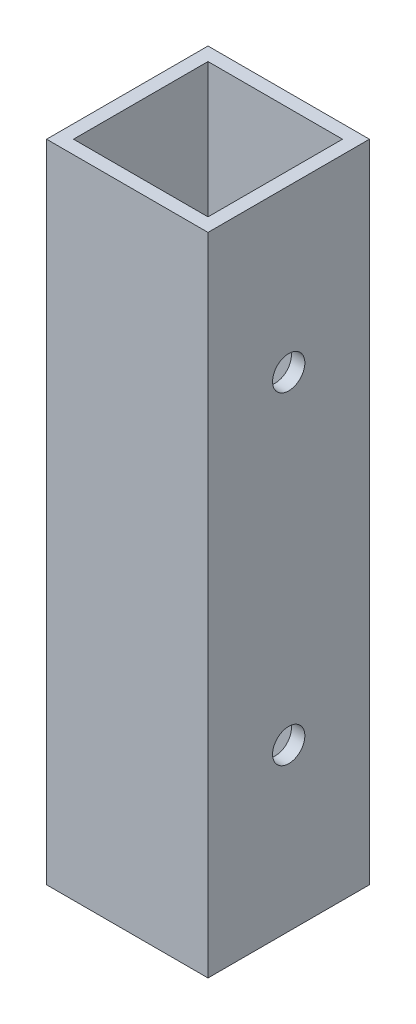
ISO-10303-21;
HEADER;
FILE_DESCRIPTION(('STEP AP214'),'2;1');
FILE_NAME('part.step','',(''),(''),'','','');
FILE_SCHEMA(('AUTOMOTIVE_DESIGN { 1 0 10303 214 1 1 1 1 }'));
ENDSEC;
DATA;
#1=APPLICATION_CONTEXT('core data for automotive mechanical design processes');
#2=APPLICATION_PROTOCOL_DEFINITION('international standard','automotive_design',2000,#1);
#3=PRODUCT_CONTEXT('',#1,'mechanical');
#4=PRODUCT('Part','Part','',(#3));
#5=PRODUCT_RELATED_PRODUCT_CATEGORY('part','',(#4));
#6=PRODUCT_DEFINITION_FORMATION('','',#4);
#7=PRODUCT_DEFINITION_CONTEXT('part definition',#1,'design');
#8=PRODUCT_DEFINITION('design','',#6,#7);
#9=PRODUCT_DEFINITION_SHAPE('','',#8);
#10=(LENGTH_UNIT() NAMED_UNIT(*) SI_UNIT(.MILLI.,.METRE.));
#11=(NAMED_UNIT(*) PLANE_ANGLE_UNIT() SI_UNIT($,.RADIAN.));
#12=(NAMED_UNIT(*) SI_UNIT($,.STERADIAN.) SOLID_ANGLE_UNIT());
#13=UNCERTAINTY_MEASURE_WITH_UNIT(LENGTH_MEASURE(1.E-05),#10,'distance_accuracy_value','');
#14=(GEOMETRIC_REPRESENTATION_CONTEXT(3) GLOBAL_UNCERTAINTY_ASSIGNED_CONTEXT((#13)) GLOBAL_UNIT_ASSIGNED_CONTEXT((#10,
#11,#12)) REPRESENTATION_CONTEXT('',''));
#15=CARTESIAN_POINT('',(0.,0.,0.));
#16=DIRECTION('',(0.,0.,1.));
#17=DIRECTION('',(1.,0.,0.));
#18=AXIS2_PLACEMENT_3D('',#15,#16,#17);
#19=CARTESIAN_POINT('',(-19.05,152.4,19.05));
#20=DIRECTION('',(0.,1.,0.));
#21=DIRECTION('',(0.,0.,1.));
#22=AXIS2_PLACEMENT_3D('',#19,#20,#21);
#23=PLANE('',#22);
#24=DIRECTION('',(0.,0.,1.));
#25=VECTOR('',#24,1.);
#26=CARTESIAN_POINT('',(-19.05,152.4,-19.05));
#27=LINE('',#26,#25);
#28=CARTESIAN_POINT('',(-19.05,152.4,-19.05));
#29=VERTEX_POINT('',#28);
#30=CARTESIAN_POINT('',(-19.05,152.4,19.05));
#31=VERTEX_POINT('',#30);
#32=EDGE_CURVE('E138',#29,#31,#27,.T.);
#33=ORIENTED_EDGE('',*,*,#32,.T.);
#34=DIRECTION('',(1.,0.,0.));
#35=VECTOR('',#34,1.);
#36=CARTESIAN_POINT('',(-19.05,152.4,19.05));
#37=LINE('',#36,#35);
#38=CARTESIAN_POINT('',(19.05,152.4,19.05));
#39=VERTEX_POINT('',#38);
#40=EDGE_CURVE('E141',#31,#39,#37,.T.);
#41=ORIENTED_EDGE('',*,*,#40,.T.);
#42=DIRECTION('',(0.,0.,-1.));
#43=VECTOR('',#42,1.);
#44=CARTESIAN_POINT('',(19.05,152.4,-19.05));
#45=LINE('',#44,#43);
#46=CARTESIAN_POINT('',(19.05,152.4,-19.05));
#47=VERTEX_POINT('',#46);
#48=EDGE_CURVE('E144',#39,#47,#45,.T.);
#49=ORIENTED_EDGE('',*,*,#48,.T.);
#50=DIRECTION('',(-1.,0.,0.));
#51=VECTOR('',#50,1.);
#52=CARTESIAN_POINT('',(-19.05,152.4,-19.05));
#53=LINE('',#52,#51);
#54=EDGE_CURVE('E146',#47,#29,#53,.T.);
#55=ORIENTED_EDGE('',*,*,#54,.T.);
#56=EDGE_LOOP('',(#33,#41,#49,#55));
#57=FACE_BOUND('',#56,.T.);
#58=DIRECTION('',(1.,0.,0.));
#59=VECTOR('',#58,1.);
#60=CARTESIAN_POINT('',(-15.875,152.4,15.875));
#61=LINE('',#60,#59);
#62=CARTESIAN_POINT('',(-15.875,152.4,15.875));
#63=VERTEX_POINT('',#62);
#64=CARTESIAN_POINT('',(15.875,152.4,15.875));
#65=VERTEX_POINT('',#64);
#66=EDGE_CURVE('E108',#63,#65,#61,.T.);
#67=ORIENTED_EDGE('',*,*,#66,.F.);
#68=DIRECTION('',(0.,0.,1.));
#69=VECTOR('',#68,1.);
#70=CARTESIAN_POINT('',(-15.875,152.4,-15.875));
#71=LINE('',#70,#69);
#72=CARTESIAN_POINT('',(-15.875,152.4,-15.875));
#73=VERTEX_POINT('',#72);
#74=EDGE_CURVE('E100',#73,#63,#71,.T.);
#75=ORIENTED_EDGE('',*,*,#74,.F.);
#76=DIRECTION('',(-1.,0.,0.));
#77=VECTOR('',#76,1.);
#78=CARTESIAN_POINT('',(-15.875,152.4,-15.875));
#79=LINE('',#78,#77);
#80=CARTESIAN_POINT('',(15.875,152.4,-15.875));
#81=VERTEX_POINT('',#80);
#82=EDGE_CURVE('E122',#81,#73,#79,.T.);
#83=ORIENTED_EDGE('',*,*,#82,.F.);
#84=DIRECTION('',(0.,0.,-1.));
#85=VECTOR('',#84,1.);
#86=CARTESIAN_POINT('',(15.875,152.4,-15.875));
#87=LINE('',#86,#85);
#88=EDGE_CURVE('E120',#65,#81,#87,.T.);
#89=ORIENTED_EDGE('',*,*,#88,.F.);
#90=EDGE_LOOP('',(#67,#75,#83,#89));
#91=FACE_BOUND('',#90,.T.);
#92=ADVANCED_FACE('F33',(#57,#91),#23,.T.);
#93=CARTESIAN_POINT('',(-19.05,0.,19.05));
#94=DIRECTION('',(0.,1.,0.));
#95=DIRECTION('',(0.,0.,1.));
#96=AXIS2_PLACEMENT_3D('',#93,#94,#95);
#97=PLANE('',#96);
#98=DIRECTION('',(0.,0.,1.));
#99=VECTOR('',#98,1.);
#100=CARTESIAN_POINT('',(-19.05,0.,-19.05));
#101=LINE('',#100,#99);
#102=CARTESIAN_POINT('',(-19.05,0.,-19.05));
#103=VERTEX_POINT('',#102);
#104=CARTESIAN_POINT('',(-19.05,0.,19.05));
#105=VERTEX_POINT('',#104);
#106=EDGE_CURVE('E116',#103,#105,#101,.T.);
#107=ORIENTED_EDGE('',*,*,#106,.F.);
#108=DIRECTION('',(-1.,0.,0.));
#109=VECTOR('',#108,1.);
#110=CARTESIAN_POINT('',(-19.05,0.,-19.05));
#111=LINE('',#110,#109);
#112=CARTESIAN_POINT('',(19.05,0.,-19.05));
#113=VERTEX_POINT('',#112);
#114=EDGE_CURVE('E142',#113,#103,#111,.T.);
#115=ORIENTED_EDGE('',*,*,#114,.F.);
#116=DIRECTION('',(0.,0.,-1.));
#117=VECTOR('',#116,1.);
#118=CARTESIAN_POINT('',(19.05,0.,-19.05));
#119=LINE('',#118,#117);
#120=CARTESIAN_POINT('',(19.05,0.,19.05));
#121=VERTEX_POINT('',#120);
#122=EDGE_CURVE('E153',#121,#113,#119,.T.);
#123=ORIENTED_EDGE('',*,*,#122,.F.);
#124=DIRECTION('',(1.,0.,0.));
#125=VECTOR('',#124,1.);
#126=CARTESIAN_POINT('',(-19.05,0.,19.05));
#127=LINE('',#126,#125);
#128=EDGE_CURVE('E151',#105,#121,#127,.T.);
#129=ORIENTED_EDGE('',*,*,#128,.F.);
#130=EDGE_LOOP('',(#107,#115,#123,#129));
#131=FACE_BOUND('',#130,.T.);
#132=DIRECTION('',(0.,0.,1.));
#133=VECTOR('',#132,1.);
#134=CARTESIAN_POINT('',(-15.875,0.,-15.875));
#135=LINE('',#134,#133);
#136=CARTESIAN_POINT('',(-15.875,0.,-15.875));
#137=VERTEX_POINT('',#136);
#138=CARTESIAN_POINT('',(-15.875,0.,15.875));
#139=VERTEX_POINT('',#138);
#140=EDGE_CURVE('E58',#137,#139,#135,.T.);
#141=ORIENTED_EDGE('',*,*,#140,.T.);
#142=DIRECTION('',(1.,0.,0.));
#143=VECTOR('',#142,1.);
#144=CARTESIAN_POINT('',(-15.875,0.,15.875));
#145=LINE('',#144,#143);
#146=CARTESIAN_POINT('',(15.875,0.,15.875));
#147=VERTEX_POINT('',#146);
#148=EDGE_CURVE('E115',#139,#147,#145,.T.);
#149=ORIENTED_EDGE('',*,*,#148,.T.);
#150=DIRECTION('',(0.,0.,-1.));
#151=VECTOR('',#150,1.);
#152=CARTESIAN_POINT('',(15.875,0.,-15.875));
#153=LINE('',#152,#151);
#154=CARTESIAN_POINT('',(15.875,0.,-15.875));
#155=VERTEX_POINT('',#154);
#156=EDGE_CURVE('E130',#147,#155,#153,.T.);
#157=ORIENTED_EDGE('',*,*,#156,.T.);
#158=DIRECTION('',(-1.,0.,0.));
#159=VECTOR('',#158,1.);
#160=CARTESIAN_POINT('',(-15.875,0.,-15.875));
#161=LINE('',#160,#159);
#162=EDGE_CURVE('E109',#155,#137,#161,.T.);
#163=ORIENTED_EDGE('',*,*,#162,.T.);
#164=EDGE_LOOP('',(#141,#149,#157,#163));
#165=FACE_BOUND('',#164,.T.);
#166=ADVANCED_FACE('F200',(#131,#165),#97,.F.);
#167=CARTESIAN_POINT('',(-19.05,152.4,-19.05));
#168=DIRECTION('',(1.,0.,0.));
#169=DIRECTION('',(0.,0.,-1.));
#170=AXIS2_PLACEMENT_3D('',#167,#168,#169);
#171=PLANE('',#170);
#172=CARTESIAN_POINT('',(-19.05,38.1,0.));
#173=DIRECTION('',(-1.,0.,0.));
#174=DIRECTION('',(0.,0.,1.));
#175=AXIS2_PLACEMENT_3D('',#172,#173,#174);
#176=CIRCLE('',#175,3.81);
#177=CARTESIAN_POINT('',(-19.05,38.1,3.81));
#178=VERTEX_POINT('',#177);
#179=EDGE_CURVE('E248',#178,#178,#176,.T.);
#180=ORIENTED_EDGE('',*,*,#179,.F.);
#181=EDGE_LOOP('',(#180));
#182=FACE_BOUND('',#181,.T.);
#183=CARTESIAN_POINT('',(-19.05,114.3,0.));
#184=DIRECTION('',(-1.,0.,0.));
#185=DIRECTION('',(0.,0.,1.));
#186=AXIS2_PLACEMENT_3D('',#183,#184,#185);
#187=CIRCLE('',#186,3.81);
#188=CARTESIAN_POINT('',(-19.05,114.3,3.81));
#189=VERTEX_POINT('',#188);
#190=EDGE_CURVE('E165',#189,#189,#187,.T.);
#191=ORIENTED_EDGE('',*,*,#190,.F.);
#192=EDGE_LOOP('',(#191));
#193=FACE_BOUND('',#192,.T.);
#194=ORIENTED_EDGE('',*,*,#106,.T.);
#195=DIRECTION('',(0.,-1.,0.));
#196=VECTOR('',#195,1.);
#197=CARTESIAN_POINT('',(-19.05,152.4,19.05));
#198=LINE('',#197,#196);
#199=EDGE_CURVE('E11',#31,#105,#198,.T.);
#200=ORIENTED_EDGE('',*,*,#199,.F.);
#201=ORIENTED_EDGE('',*,*,#32,.F.);
#202=DIRECTION('',(0.,-1.,0.));
#203=VECTOR('',#202,1.);
#204=CARTESIAN_POINT('',(-19.05,152.4,-19.05));
#205=LINE('',#204,#203);
#206=EDGE_CURVE('E148',#29,#103,#205,.T.);
#207=ORIENTED_EDGE('',*,*,#206,.T.);
#208=EDGE_LOOP('',(#194,#200,#201,#207));
#209=FACE_BOUND('',#208,.T.);
#210=ADVANCED_FACE('F35',(#182,#193,#209),#171,.F.);
#211=CARTESIAN_POINT('',(-19.05,152.4,19.05));
#212=DIRECTION('',(0.,0.,-1.));
#213=DIRECTION('',(-1.,0.,0.));
#214=AXIS2_PLACEMENT_3D('',#211,#212,#213);
#215=PLANE('',#214);
#216=ORIENTED_EDGE('',*,*,#128,.T.);
#217=DIRECTION('',(0.,-1.,0.));
#218=VECTOR('',#217,1.);
#219=CARTESIAN_POINT('',(19.05,152.4,19.05));
#220=LINE('',#219,#218);
#221=EDGE_CURVE('E42',#39,#121,#220,.T.);
#222=ORIENTED_EDGE('',*,*,#221,.F.);
#223=ORIENTED_EDGE('',*,*,#40,.F.);
#224=ORIENTED_EDGE('',*,*,#199,.T.);
#225=EDGE_LOOP('',(#216,#222,#223,#224));
#226=FACE_BOUND('',#225,.T.);
#227=ADVANCED_FACE('F216',(#226),#215,.F.);
#228=CARTESIAN_POINT('',(19.05,152.4,-19.05));
#229=DIRECTION('',(-1.,0.,0.));
#230=DIRECTION('',(0.,0.,1.));
#231=AXIS2_PLACEMENT_3D('',#228,#229,#230);
#232=PLANE('',#231);
#233=CARTESIAN_POINT('',(19.05,38.1,0.));
#234=DIRECTION('',(-1.,0.,0.));
#235=DIRECTION('',(0.,0.,1.));
#236=AXIS2_PLACEMENT_3D('',#233,#234,#235);
#237=CIRCLE('',#236,3.81);
#238=CARTESIAN_POINT('',(19.05,38.1,3.81));
#239=VERTEX_POINT('',#238);
#240=EDGE_CURVE('E171',#239,#239,#237,.T.);
#241=ORIENTED_EDGE('',*,*,#240,.T.);
#242=EDGE_LOOP('',(#241));
#243=FACE_BOUND('',#242,.T.);
#244=CARTESIAN_POINT('',(19.05,114.3,0.));
#245=DIRECTION('',(-1.,0.,0.));
#246=DIRECTION('',(0.,0.,1.));
#247=AXIS2_PLACEMENT_3D('',#244,#245,#246);
#248=CIRCLE('',#247,3.81);
#249=CARTESIAN_POINT('',(19.05,114.3,3.81));
#250=VERTEX_POINT('',#249);
#251=EDGE_CURVE('E128',#250,#250,#248,.T.);
#252=ORIENTED_EDGE('',*,*,#251,.T.);
#253=EDGE_LOOP('',(#252));
#254=FACE_BOUND('',#253,.T.);
#255=ORIENTED_EDGE('',*,*,#122,.T.);
#256=DIRECTION('',(0.,-1.,0.));
#257=VECTOR('',#256,1.);
#258=CARTESIAN_POINT('',(19.05,152.4,-19.05));
#259=LINE('',#258,#257);
#260=EDGE_CURVE('E158',#47,#113,#259,.T.);
#261=ORIENTED_EDGE('',*,*,#260,.F.);
#262=ORIENTED_EDGE('',*,*,#48,.F.);
#263=ORIENTED_EDGE('',*,*,#221,.T.);
#264=EDGE_LOOP('',(#255,#261,#262,#263));
#265=FACE_BOUND('',#264,.T.);
#266=ADVANCED_FACE('F182',(#243,#254,#265),#232,.F.);
#267=CARTESIAN_POINT('',(-19.05,152.4,-19.05));
#268=DIRECTION('',(0.,0.,1.));
#269=DIRECTION('',(1.,0.,0.));
#270=AXIS2_PLACEMENT_3D('',#267,#268,#269);
#271=PLANE('',#270);
#272=ORIENTED_EDGE('',*,*,#114,.T.);
#273=ORIENTED_EDGE('',*,*,#206,.F.);
#274=ORIENTED_EDGE('',*,*,#54,.F.);
#275=ORIENTED_EDGE('',*,*,#260,.T.);
#276=EDGE_LOOP('',(#272,#273,#274,#275));
#277=FACE_BOUND('',#276,.T.);
#278=ADVANCED_FACE('F211',(#277),#271,.F.);
#279=CARTESIAN_POINT('',(-15.875,152.4,-15.875));
#280=DIRECTION('',(1.,0.,0.));
#281=DIRECTION('',(0.,0.,-1.));
#282=AXIS2_PLACEMENT_3D('',#279,#280,#281);
#283=PLANE('',#282);
#284=CARTESIAN_POINT('',(-15.875,38.1,0.));
#285=DIRECTION('',(1.,0.,0.));
#286=DIRECTION('',(0.,0.,-1.));
#287=AXIS2_PLACEMENT_3D('',#284,#285,#286);
#288=CIRCLE('',#287,3.81);
#289=CARTESIAN_POINT('',(-15.875,38.1,-3.81));
#290=VERTEX_POINT('',#289);
#291=EDGE_CURVE('E176',#290,#290,#288,.T.);
#292=ORIENTED_EDGE('',*,*,#291,.F.);
#293=EDGE_LOOP('',(#292));
#294=FACE_BOUND('',#293,.T.);
#295=CARTESIAN_POINT('',(-15.875,114.3,0.));
#296=DIRECTION('',(1.,0.,0.));
#297=DIRECTION('',(0.,0.,-1.));
#298=AXIS2_PLACEMENT_3D('',#295,#296,#297);
#299=CIRCLE('',#298,3.81);
#300=CARTESIAN_POINT('',(-15.875,114.3,-3.81));
#301=VERTEX_POINT('',#300);
#302=EDGE_CURVE('E164',#301,#301,#299,.T.);
#303=ORIENTED_EDGE('',*,*,#302,.F.);
#304=EDGE_LOOP('',(#303));
#305=FACE_BOUND('',#304,.T.);
#306=ORIENTED_EDGE('',*,*,#140,.F.);
#307=DIRECTION('',(0.,-1.,0.));
#308=VECTOR('',#307,1.);
#309=CARTESIAN_POINT('',(-15.875,152.4,-15.875));
#310=LINE('',#309,#308);
#311=EDGE_CURVE('E104',#73,#137,#310,.T.);
#312=ORIENTED_EDGE('',*,*,#311,.F.);
#313=ORIENTED_EDGE('',*,*,#74,.T.);
#314=DIRECTION('',(0.,-1.,0.));
#315=VECTOR('',#314,1.);
#316=CARTESIAN_POINT('',(-15.875,152.4,15.875));
#317=LINE('',#316,#315);
#318=EDGE_CURVE('E103',#63,#139,#317,.T.);
#319=ORIENTED_EDGE('',*,*,#318,.T.);
#320=EDGE_LOOP('',(#306,#312,#313,#319));
#321=FACE_BOUND('',#320,.T.);
#322=ADVANCED_FACE('F102',(#294,#305,#321),#283,.T.);
#323=CARTESIAN_POINT('',(-15.875,152.4,15.875));
#324=DIRECTION('',(0.,0.,-1.));
#325=DIRECTION('',(-1.,0.,0.));
#326=AXIS2_PLACEMENT_3D('',#323,#324,#325);
#327=PLANE('',#326);
#328=ORIENTED_EDGE('',*,*,#148,.F.);
#329=ORIENTED_EDGE('',*,*,#318,.F.);
#330=ORIENTED_EDGE('',*,*,#66,.T.);
#331=DIRECTION('',(0.,-1.,0.));
#332=VECTOR('',#331,1.);
#333=CARTESIAN_POINT('',(15.875,152.4,15.875));
#334=LINE('',#333,#332);
#335=EDGE_CURVE('E117',#65,#147,#334,.T.);
#336=ORIENTED_EDGE('',*,*,#335,.T.);
#337=EDGE_LOOP('',(#328,#329,#330,#336));
#338=FACE_BOUND('',#337,.T.);
#339=ADVANCED_FACE('F112',(#338),#327,.T.);
#340=CARTESIAN_POINT('',(15.875,152.4,-15.875));
#341=DIRECTION('',(-1.,0.,0.));
#342=DIRECTION('',(0.,0.,1.));
#343=AXIS2_PLACEMENT_3D('',#340,#341,#342);
#344=PLANE('',#343);
#345=CARTESIAN_POINT('',(15.875,38.1,0.));
#346=DIRECTION('',(-1.,0.,0.));
#347=DIRECTION('',(0.,0.,1.));
#348=AXIS2_PLACEMENT_3D('',#345,#346,#347);
#349=CIRCLE('',#348,3.81);
#350=CARTESIAN_POINT('',(15.875,38.1,3.81));
#351=VERTEX_POINT('',#350);
#352=EDGE_CURVE('E37',#351,#351,#349,.T.);
#353=ORIENTED_EDGE('',*,*,#352,.F.);
#354=EDGE_LOOP('',(#353));
#355=FACE_BOUND('',#354,.T.);
#356=CARTESIAN_POINT('',(15.875,114.3,0.));
#357=DIRECTION('',(-1.,0.,0.));
#358=DIRECTION('',(0.,0.,1.));
#359=AXIS2_PLACEMENT_3D('',#356,#357,#358);
#360=CIRCLE('',#359,3.81);
#361=CARTESIAN_POINT('',(15.875,114.3,3.81));
#362=VERTEX_POINT('',#361);
#363=EDGE_CURVE('E162',#362,#362,#360,.T.);
#364=ORIENTED_EDGE('',*,*,#363,.F.);
#365=EDGE_LOOP('',(#364));
#366=FACE_BOUND('',#365,.T.);
#367=ORIENTED_EDGE('',*,*,#156,.F.);
#368=ORIENTED_EDGE('',*,*,#335,.F.);
#369=ORIENTED_EDGE('',*,*,#88,.T.);
#370=DIRECTION('',(0.,-1.,0.));
#371=VECTOR('',#370,1.);
#372=CARTESIAN_POINT('',(15.875,152.4,-15.875));
#373=LINE('',#372,#371);
#374=EDGE_CURVE('E50',#81,#155,#373,.T.);
#375=ORIENTED_EDGE('',*,*,#374,.T.);
#376=EDGE_LOOP('',(#367,#368,#369,#375));
#377=FACE_BOUND('',#376,.T.);
#378=ADVANCED_FACE('F196',(#355,#366,#377),#344,.T.);
#379=CARTESIAN_POINT('',(-15.875,152.4,-15.875));
#380=DIRECTION('',(0.,0.,1.));
#381=DIRECTION('',(1.,0.,0.));
#382=AXIS2_PLACEMENT_3D('',#379,#380,#381);
#383=PLANE('',#382);
#384=ORIENTED_EDGE('',*,*,#162,.F.);
#385=ORIENTED_EDGE('',*,*,#374,.F.);
#386=ORIENTED_EDGE('',*,*,#82,.T.);
#387=ORIENTED_EDGE('',*,*,#311,.T.);
#388=EDGE_LOOP('',(#384,#385,#386,#387));
#389=FACE_BOUND('',#388,.T.);
#390=ADVANCED_FACE('F188',(#389),#383,.T.);
#391=CARTESIAN_POINT('',(133.35,114.3,0.));
#392=DIRECTION('',(-1.,0.,0.));
#393=DIRECTION('',(0.,0.,1.));
#394=AXIS2_PLACEMENT_3D('',#391,#392,#393);
#395=CYLINDRICAL_SURFACE('',#394,3.81);
#396=ORIENTED_EDGE('',*,*,#363,.T.);
#397=EDGE_LOOP('',(#396));
#398=FACE_BOUND('',#397,.T.);
#399=ORIENTED_EDGE('',*,*,#251,.F.);
#400=EDGE_LOOP('',(#399));
#401=FACE_BOUND('',#400,.T.);
#402=ADVANCED_FACE('F185',(#398,#401),#395,.F.);
#403=ORIENTED_EDGE('',*,*,#302,.T.);
#404=EDGE_LOOP('',(#403));
#405=FACE_BOUND('',#404,.T.);
#406=ORIENTED_EDGE('',*,*,#190,.T.);
#407=EDGE_LOOP('',(#406));
#408=FACE_BOUND('',#407,.T.);
#409=ADVANCED_FACE('F187',(#405,#408),#395,.F.);
#410=CARTESIAN_POINT('',(133.35,38.1,0.));
#411=DIRECTION('',(-1.,0.,0.));
#412=DIRECTION('',(0.,0.,1.));
#413=AXIS2_PLACEMENT_3D('',#410,#411,#412);
#414=CYLINDRICAL_SURFACE('',#413,3.81);
#415=ORIENTED_EDGE('',*,*,#352,.T.);
#416=EDGE_LOOP('',(#415));
#417=FACE_BOUND('',#416,.T.);
#418=ORIENTED_EDGE('',*,*,#240,.F.);
#419=EDGE_LOOP('',(#418));
#420=FACE_BOUND('',#419,.T.);
#421=ADVANCED_FACE('F194',(#417,#420),#414,.F.);
#422=ORIENTED_EDGE('',*,*,#291,.T.);
#423=EDGE_LOOP('',(#422));
#424=FACE_BOUND('',#423,.T.);
#425=ORIENTED_EDGE('',*,*,#179,.T.);
#426=EDGE_LOOP('',(#425));
#427=FACE_BOUND('',#426,.T.);
#428=ADVANCED_FACE('F254',(#424,#427),#414,.F.);
#429=CLOSED_SHELL('',(#92,#166,#210,#227,#266,#278,#322,#339,#378,#390,#402,#409,#421,#428));
#430=MANIFOLD_SOLID_BREP('B2',#429);
#431=ADVANCED_BREP_SHAPE_REPRESENTATION('',(#18,#430),#14);
#432=SHAPE_DEFINITION_REPRESENTATION(#9,#431);
ENDSEC;
END-ISO-10303-21;
